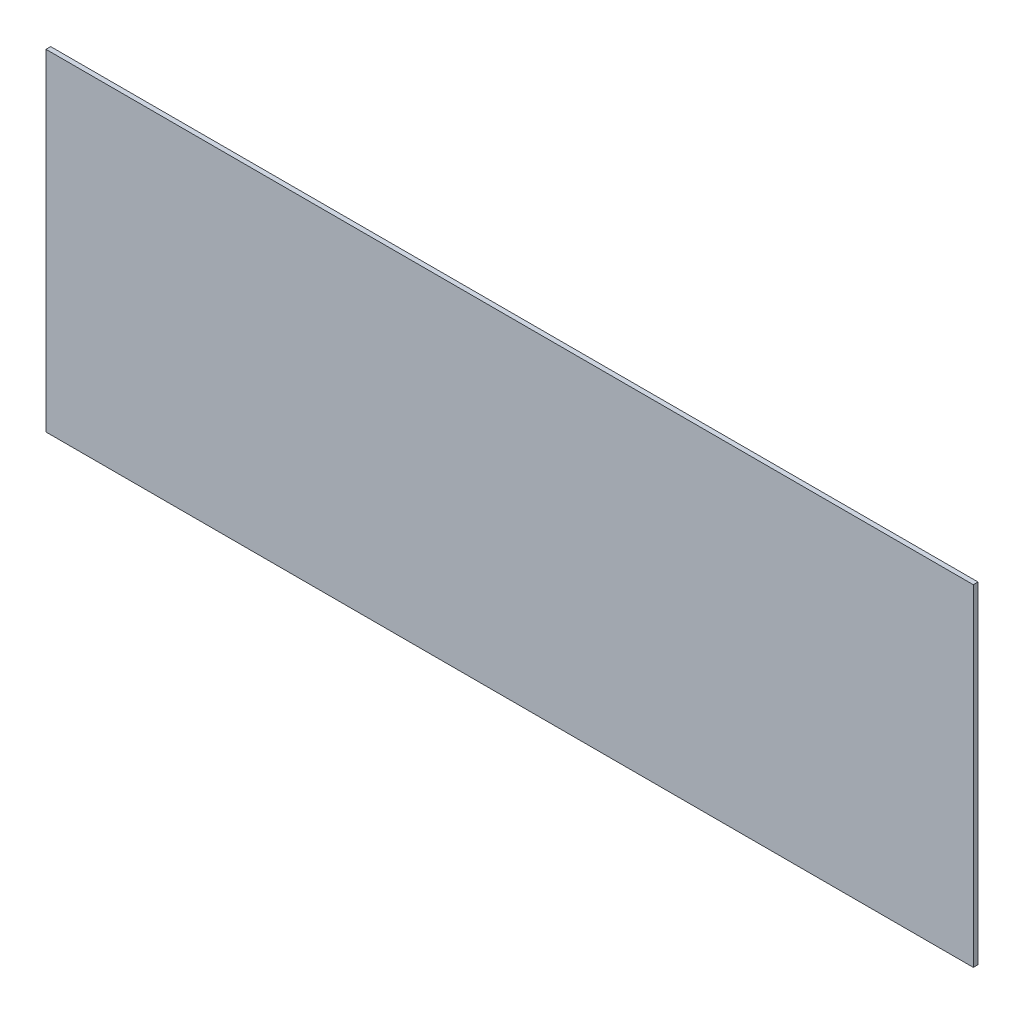
ISO-10303-21;
HEADER;
FILE_DESCRIPTION(('STEP AP214'),'2;1');
FILE_NAME('part.step','',(''),(''),'','','');
FILE_SCHEMA(('AUTOMOTIVE_DESIGN { 1 0 10303 214 1 1 1 1 }'));
ENDSEC;
DATA;
#1=APPLICATION_CONTEXT('core data for automotive mechanical design processes');
#2=APPLICATION_PROTOCOL_DEFINITION('international standard','automotive_design',2000,#1);
#3=PRODUCT_CONTEXT('',#1,'mechanical');
#4=PRODUCT('Part','Part','',(#3));
#5=PRODUCT_RELATED_PRODUCT_CATEGORY('part','',(#4));
#6=PRODUCT_DEFINITION_FORMATION('','',#4);
#7=PRODUCT_DEFINITION_CONTEXT('part definition',#1,'design');
#8=PRODUCT_DEFINITION('design','',#6,#7);
#9=PRODUCT_DEFINITION_SHAPE('','',#8);
#10=(LENGTH_UNIT() NAMED_UNIT(*) SI_UNIT(.MILLI.,.METRE.));
#11=(NAMED_UNIT(*) PLANE_ANGLE_UNIT() SI_UNIT($,.RADIAN.));
#12=(NAMED_UNIT(*) SI_UNIT($,.STERADIAN.) SOLID_ANGLE_UNIT());
#13=UNCERTAINTY_MEASURE_WITH_UNIT(LENGTH_MEASURE(1.E-05),#10,'distance_accuracy_value','');
#14=(GEOMETRIC_REPRESENTATION_CONTEXT(3) GLOBAL_UNCERTAINTY_ASSIGNED_CONTEXT((#13)) GLOBAL_UNIT_ASSIGNED_CONTEXT((#10,
#11,#12)) REPRESENTATION_CONTEXT('',''));
#15=CARTESIAN_POINT('',(0.,0.,0.));
#16=DIRECTION('',(0.,0.,1.));
#17=DIRECTION('',(1.,0.,0.));
#18=AXIS2_PLACEMENT_3D('',#15,#16,#17);
#19=CARTESIAN_POINT('',(98.2,-35.1,1.));
#20=DIRECTION('',(-1.,0.,0.));
#21=DIRECTION('',(0.,0.,1.));
#22=AXIS2_PLACEMENT_3D('',#19,#20,#21);
#23=PLANE('',#22);
#24=DIRECTION('',(0.,1.,0.));
#25=VECTOR('',#24,1.);
#26=CARTESIAN_POINT('',(98.2,-35.1,0.));
#27=LINE('',#26,#25);
#28=CARTESIAN_POINT('',(98.2,-35.1,0.));
#29=VERTEX_POINT('',#28);
#30=CARTESIAN_POINT('',(98.2,35.1,0.));
#31=VERTEX_POINT('',#30);
#32=EDGE_CURVE('E96',#29,#31,#27,.T.);
#33=ORIENTED_EDGE('',*,*,#32,.T.);
#34=DIRECTION('',(0.,0.,-1.));
#35=VECTOR('',#34,1.);
#36=CARTESIAN_POINT('',(98.2,35.1,1.));
#37=LINE('',#36,#35);
#38=CARTESIAN_POINT('',(98.2,35.1,1.));
#39=VERTEX_POINT('',#38);
#40=EDGE_CURVE('E11',#39,#31,#37,.T.);
#41=ORIENTED_EDGE('',*,*,#40,.F.);
#42=DIRECTION('',(0.,1.,0.));
#43=VECTOR('',#42,1.);
#44=CARTESIAN_POINT('',(98.2,-35.1,1.));
#45=LINE('',#44,#43);
#46=CARTESIAN_POINT('',(98.2,-35.1,1.));
#47=VERTEX_POINT('',#46);
#48=EDGE_CURVE('E84',#47,#39,#45,.T.);
#49=ORIENTED_EDGE('',*,*,#48,.F.);
#50=DIRECTION('',(0.,0.,-1.));
#51=VECTOR('',#50,1.);
#52=CARTESIAN_POINT('',(98.2,-35.1,1.));
#53=LINE('',#52,#51);
#54=EDGE_CURVE('E92',#47,#29,#53,.T.);
#55=ORIENTED_EDGE('',*,*,#54,.T.);
#56=EDGE_LOOP('',(#33,#41,#49,#55));
#57=FACE_BOUND('',#56,.T.);
#58=ADVANCED_FACE('F33',(#57),#23,.F.);
#59=CARTESIAN_POINT('',(-98.2,35.1,1.));
#60=DIRECTION('',(0.,-1.,0.));
#61=DIRECTION('',(0.,0.,-1.));
#62=AXIS2_PLACEMENT_3D('',#59,#60,#61);
#63=PLANE('',#62);
#64=DIRECTION('',(-1.,0.,0.));
#65=VECTOR('',#64,1.);
#66=CARTESIAN_POINT('',(-98.2,35.1,0.));
#67=LINE('',#66,#65);
#68=CARTESIAN_POINT('',(-98.2,35.1,0.));
#69=VERTEX_POINT('',#68);
#70=EDGE_CURVE('E88',#31,#69,#67,.T.);
#71=ORIENTED_EDGE('',*,*,#70,.T.);
#72=DIRECTION('',(0.,0.,-1.));
#73=VECTOR('',#72,1.);
#74=CARTESIAN_POINT('',(-98.2,35.1,1.));
#75=LINE('',#74,#73);
#76=CARTESIAN_POINT('',(-98.2,35.1,1.));
#77=VERTEX_POINT('',#76);
#78=EDGE_CURVE('E41',#77,#69,#75,.T.);
#79=ORIENTED_EDGE('',*,*,#78,.F.);
#80=DIRECTION('',(-1.,0.,0.));
#81=VECTOR('',#80,1.);
#82=CARTESIAN_POINT('',(-98.2,35.1,1.));
#83=LINE('',#82,#81);
#84=EDGE_CURVE('E79',#39,#77,#83,.T.);
#85=ORIENTED_EDGE('',*,*,#84,.F.);
#86=ORIENTED_EDGE('',*,*,#40,.T.);
#87=EDGE_LOOP('',(#71,#79,#85,#86));
#88=FACE_BOUND('',#87,.T.);
#89=ADVANCED_FACE('F87',(#88),#63,.F.);
#90=CARTESIAN_POINT('',(-98.2,-35.1,1.));
#91=DIRECTION('',(1.,0.,0.));
#92=DIRECTION('',(0.,0.,-1.));
#93=AXIS2_PLACEMENT_3D('',#90,#91,#92);
#94=PLANE('',#93);
#95=DIRECTION('',(0.,-1.,0.));
#96=VECTOR('',#95,1.);
#97=CARTESIAN_POINT('',(-98.2,-35.1,0.));
#98=LINE('',#97,#96);
#99=CARTESIAN_POINT('',(-98.2,-35.1,0.));
#100=VERTEX_POINT('',#99);
#101=EDGE_CURVE('E66',#69,#100,#98,.T.);
#102=ORIENTED_EDGE('',*,*,#101,.T.);
#103=DIRECTION('',(0.,0.,-1.));
#104=VECTOR('',#103,1.);
#105=CARTESIAN_POINT('',(-98.2,-35.1,1.));
#106=LINE('',#105,#104);
#107=CARTESIAN_POINT('',(-98.2,-35.1,1.));
#108=VERTEX_POINT('',#107);
#109=EDGE_CURVE('E89',#108,#100,#106,.T.);
#110=ORIENTED_EDGE('',*,*,#109,.F.);
#111=DIRECTION('',(0.,-1.,0.));
#112=VECTOR('',#111,1.);
#113=CARTESIAN_POINT('',(-98.2,-35.1,1.));
#114=LINE('',#113,#112);
#115=EDGE_CURVE('E82',#77,#108,#114,.T.);
#116=ORIENTED_EDGE('',*,*,#115,.F.);
#117=ORIENTED_EDGE('',*,*,#78,.T.);
#118=EDGE_LOOP('',(#102,#110,#116,#117));
#119=FACE_BOUND('',#118,.T.);
#120=ADVANCED_FACE('F90',(#119),#94,.F.);
#121=CARTESIAN_POINT('',(-98.2,-35.1,1.));
#122=DIRECTION('',(0.,1.,0.));
#123=DIRECTION('',(0.,0.,1.));
#124=AXIS2_PLACEMENT_3D('',#121,#122,#123);
#125=PLANE('',#124);
#126=DIRECTION('',(1.,0.,0.));
#127=VECTOR('',#126,1.);
#128=CARTESIAN_POINT('',(-98.2,-35.1,0.));
#129=LINE('',#128,#127);
#130=EDGE_CURVE('E72',#100,#29,#129,.T.);
#131=ORIENTED_EDGE('',*,*,#130,.T.);
#132=ORIENTED_EDGE('',*,*,#54,.F.);
#133=DIRECTION('',(1.,0.,0.));
#134=VECTOR('',#133,1.);
#135=CARTESIAN_POINT('',(-98.2,-35.1,1.));
#136=LINE('',#135,#134);
#137=EDGE_CURVE('E49',#108,#47,#136,.T.);
#138=ORIENTED_EDGE('',*,*,#137,.F.);
#139=ORIENTED_EDGE('',*,*,#109,.T.);
#140=EDGE_LOOP('',(#131,#132,#138,#139));
#141=FACE_BOUND('',#140,.T.);
#142=ADVANCED_FACE('F103',(#141),#125,.F.);
#143=CARTESIAN_POINT('',(0.,0.,1.));
#144=DIRECTION('',(0.,0.,-1.));
#145=DIRECTION('',(-1.,0.,0.));
#146=AXIS2_PLACEMENT_3D('',#143,#144,#145);
#147=PLANE('',#146);
#148=ORIENTED_EDGE('',*,*,#48,.T.);
#149=ORIENTED_EDGE('',*,*,#84,.T.);
#150=ORIENTED_EDGE('',*,*,#115,.T.);
#151=ORIENTED_EDGE('',*,*,#137,.T.);
#152=EDGE_LOOP('',(#148,#149,#150,#151));
#153=FACE_BOUND('',#152,.T.);
#154=ADVANCED_FACE('F80',(#153),#147,.F.);
#155=CARTESIAN_POINT('',(0.,0.,0.));
#156=DIRECTION('',(0.,0.,-1.));
#157=DIRECTION('',(-1.,0.,0.));
#158=AXIS2_PLACEMENT_3D('',#155,#156,#157);
#159=PLANE('',#158);
#160=ORIENTED_EDGE('',*,*,#32,.F.);
#161=ORIENTED_EDGE('',*,*,#130,.F.);
#162=ORIENTED_EDGE('',*,*,#101,.F.);
#163=ORIENTED_EDGE('',*,*,#70,.F.);
#164=EDGE_LOOP('',(#160,#161,#162,#163));
#165=FACE_BOUND('',#164,.T.);
#166=ADVANCED_FACE('F106',(#165),#159,.T.);
#167=CLOSED_SHELL('',(#58,#89,#120,#142,#154,#166));
#168=MANIFOLD_SOLID_BREP('B2',#167);
#169=ADVANCED_BREP_SHAPE_REPRESENTATION('',(#18,#168),#14);
#170=SHAPE_DEFINITION_REPRESENTATION(#9,#169);
ENDSEC;
END-ISO-10303-21;
